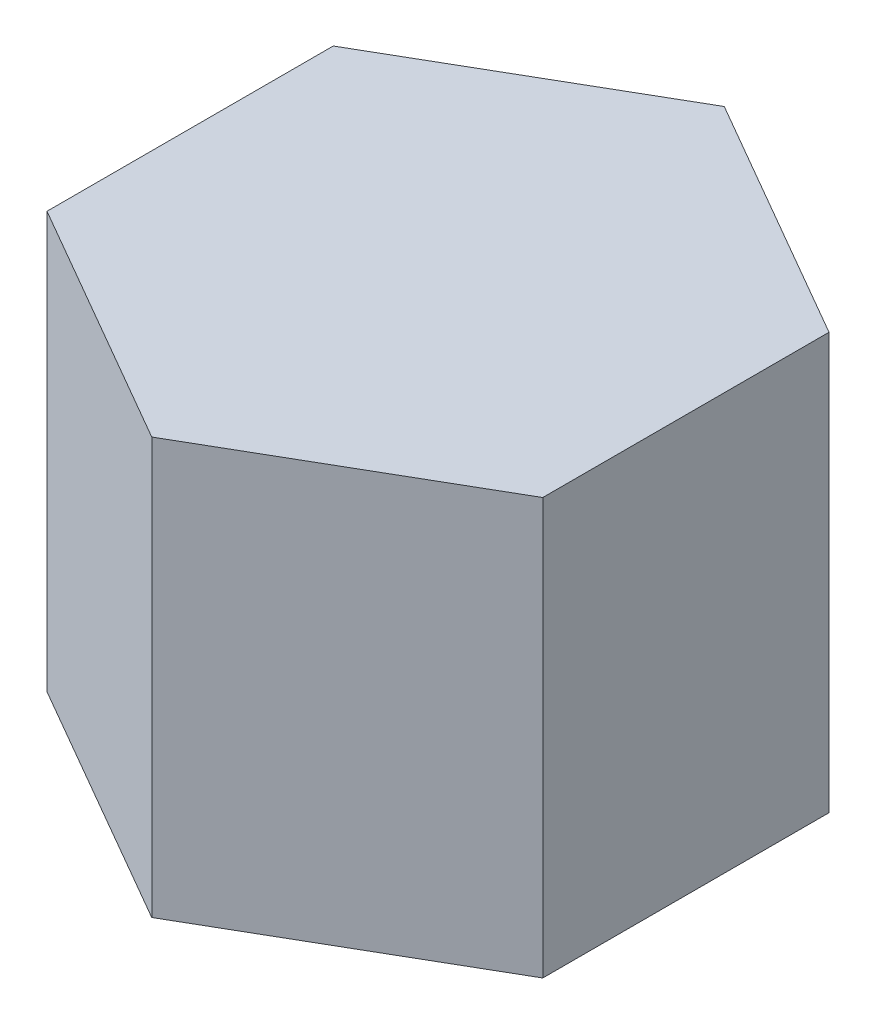
ISO-10303-21;
HEADER;
FILE_DESCRIPTION(('STEP AP214'),'2;1');
FILE_NAME('part.step','',(''),(''),'','','');
FILE_SCHEMA(('AUTOMOTIVE_DESIGN { 1 0 10303 214 1 1 1 1 }'));
ENDSEC;
DATA;
#1=APPLICATION_CONTEXT('core data for automotive mechanical design processes');
#2=APPLICATION_PROTOCOL_DEFINITION('international standard','automotive_design',2000,#1);
#3=PRODUCT_CONTEXT('',#1,'mechanical');
#4=PRODUCT('Part','Part','',(#3));
#5=PRODUCT_RELATED_PRODUCT_CATEGORY('part','',(#4));
#6=PRODUCT_DEFINITION_FORMATION('','',#4);
#7=PRODUCT_DEFINITION_CONTEXT('part definition',#1,'design');
#8=PRODUCT_DEFINITION('design','',#6,#7);
#9=PRODUCT_DEFINITION_SHAPE('','',#8);
#10=(LENGTH_UNIT() NAMED_UNIT(*) SI_UNIT(.MILLI.,.METRE.));
#11=(NAMED_UNIT(*) PLANE_ANGLE_UNIT() SI_UNIT($,.RADIAN.));
#12=(NAMED_UNIT(*) SI_UNIT($,.STERADIAN.) SOLID_ANGLE_UNIT());
#13=UNCERTAINTY_MEASURE_WITH_UNIT(LENGTH_MEASURE(1.E-05),#10,'distance_accuracy_value','');
#14=(GEOMETRIC_REPRESENTATION_CONTEXT(3) GLOBAL_UNCERTAINTY_ASSIGNED_CONTEXT((#13)) GLOBAL_UNIT_ASSIGNED_CONTEXT((#10,
#11,#12)) REPRESENTATION_CONTEXT('',''));
#15=CARTESIAN_POINT('',(0.,0.,0.));
#16=DIRECTION('',(0.,0.,1.));
#17=DIRECTION('',(1.,0.,0.));
#18=AXIS2_PLACEMENT_3D('',#15,#16,#17);
#19=CARTESIAN_POINT('',(205.339551417382,-147.556598747966,293.414022028063));
#20=DIRECTION('',(-0.500000000000096,0.,-0.866025403784383));
#21=DIRECTION('',(-0.866025403784383,0.,0.500000000000096));
#22=AXIS2_PLACEMENT_3D('',#19,#20,#21);
#23=PLANE('',#22);
#24=CARTESIAN_POINT('',(205.642660308706,-147.047793579175,293.239022028063));
#25=DIRECTION('',(-0.866025403784383,0.,0.500000000000096));
#26=VECTOR('',#25,1.);
#27=LINE('',#24,#26);
#28=CARTESIAN_POINT('',(205.642660308706,-147.047793579175,293.239022028063));
#29=VERTEX_POINT('',#28);
#30=CARTESIAN_POINT('',(205.339551417382,-147.047793579175,293.414022028063));
#31=VERTEX_POINT('',#30);
#32=EDGE_CURVE('E170',#29,#31,#27,.T.);
#33=ORIENTED_EDGE('',*,*,#32,.T.);
#34=CARTESIAN_POINT('',(205.339551417382,-147.556598747966,293.414022028063));
#35=DIRECTION('',(0.,1.,0.));
#36=VECTOR('',#35,1.);
#37=LINE('',#34,#36);
#38=CARTESIAN_POINT('',(205.339551417382,-147.556598747966,293.414022028063));
#39=VERTEX_POINT('',#38);
#40=EDGE_CURVE('E35',#39,#31,#37,.T.);
#41=ORIENTED_EDGE('',*,*,#40,.F.);
#42=CARTESIAN_POINT('',(205.642660308706,-147.556598747966,293.239022028063));
#43=DIRECTION('',(-0.866025403784383,0.,0.500000000000096));
#44=VECTOR('',#43,1.);
#45=LINE('',#42,#44);
#46=CARTESIAN_POINT('',(205.642660308706,-147.556598747966,293.239022028063));
#47=VERTEX_POINT('',#46);
#48=EDGE_CURVE('E159',#47,#39,#45,.T.);
#49=ORIENTED_EDGE('',*,*,#48,.F.);
#50=CARTESIAN_POINT('',(205.642660308706,-147.556598747966,293.239022028063));
#51=DIRECTION('',(0.,1.,0.));
#52=VECTOR('',#51,1.);
#53=LINE('',#50,#52);
#54=EDGE_CURVE('E10',#47,#29,#53,.T.);
#55=ORIENTED_EDGE('',*,*,#54,.T.);
#56=EDGE_LOOP('',(#33,#41,#49,#55));
#57=FACE_BOUND('',#56,.T.);
#58=ADVANCED_FACE('F16',(#57),#23,.F.);
#59=CARTESIAN_POINT('',(205.642660308706,-147.556598747966,291.594471220494));
#60=DIRECTION('',(-1.,0.,0.));
#61=DIRECTION('',(0.,-1.,0.));
#62=AXIS2_PLACEMENT_3D('',#59,#60,#61);
#63=PLANE('',#62);
#64=CARTESIAN_POINT('',(205.642660308706,-147.047793579175,292.889022028063));
#65=DIRECTION('',(0.,0.,1.));
#66=VECTOR('',#65,1.);
#67=LINE('',#64,#66);
#68=CARTESIAN_POINT('',(205.642660308706,-147.047793579175,292.889022028063));
#69=VERTEX_POINT('',#68);
#70=EDGE_CURVE('E167',#69,#29,#67,.T.);
#71=ORIENTED_EDGE('',*,*,#70,.T.);
#72=ORIENTED_EDGE('',*,*,#54,.F.);
#73=CARTESIAN_POINT('',(205.642660308706,-147.556598747966,292.889022028063));
#74=DIRECTION('',(0.,0.,1.));
#75=VECTOR('',#74,1.);
#76=LINE('',#73,#75);
#77=CARTESIAN_POINT('',(205.642660308706,-147.556598747966,292.889022028063));
#78=VERTEX_POINT('',#77);
#79=EDGE_CURVE('E156',#78,#47,#76,.T.);
#80=ORIENTED_EDGE('',*,*,#79,.F.);
#81=CARTESIAN_POINT('',(205.642660308706,-147.556598747966,292.889022028063));
#82=DIRECTION('',(0.,1.,0.));
#83=VECTOR('',#82,1.);
#84=LINE('',#81,#83);
#85=EDGE_CURVE('E27',#78,#69,#84,.T.);
#86=ORIENTED_EDGE('',*,*,#85,.T.);
#87=EDGE_LOOP('',(#71,#72,#80,#86));
#88=FACE_BOUND('',#87,.T.);
#89=ADVANCED_FACE('F189',(#88),#63,.F.);
#90=CARTESIAN_POINT('',(205.642660308706,-147.556598747966,292.889022028063));
#91=DIRECTION('',(-0.500000000000062,0.,0.866025403784403));
#92=DIRECTION('',(0.866025403784403,0.,0.500000000000062));
#93=AXIS2_PLACEMENT_3D('',#90,#91,#92);
#94=PLANE('',#93);
#95=CARTESIAN_POINT('',(205.339551417381,-147.047793579175,292.714022028063));
#96=DIRECTION('',(0.866025403784403,0.,0.500000000000062));
#97=VECTOR('',#96,1.);
#98=LINE('',#95,#97);
#99=CARTESIAN_POINT('',(205.339551417382,-147.047793579175,292.714022028063));
#100=VERTEX_POINT('',#99);
#101=EDGE_CURVE('E163',#100,#69,#98,.T.);
#102=ORIENTED_EDGE('',*,*,#101,.T.);
#103=ORIENTED_EDGE('',*,*,#85,.F.);
#104=CARTESIAN_POINT('',(205.339551417381,-147.556598747966,292.714022028063));
#105=DIRECTION('',(0.866025403784403,0.,0.500000000000062));
#106=VECTOR('',#105,1.);
#107=LINE('',#104,#106);
#108=CARTESIAN_POINT('',(205.339551417382,-147.556598747966,292.714022028063));
#109=VERTEX_POINT('',#108);
#110=EDGE_CURVE('E106',#109,#78,#107,.T.);
#111=ORIENTED_EDGE('',*,*,#110,.F.);
#112=CARTESIAN_POINT('',(205.339551417381,-147.556598747966,292.714022028063));
#113=DIRECTION('',(0.,1.,0.));
#114=VECTOR('',#113,1.);
#115=LINE('',#112,#114);
#116=EDGE_CURVE('E94',#109,#100,#115,.T.);
#117=ORIENTED_EDGE('',*,*,#116,.T.);
#118=EDGE_LOOP('',(#102,#103,#111,#117));
#119=FACE_BOUND('',#118,.T.);
#120=ADVANCED_FACE('F198',(#119),#94,.F.);
#121=CARTESIAN_POINT('',(205.339551417382,-147.556598747966,292.714022028063));
#122=DIRECTION('',(0.500000000000062,0.,0.866025403784403));
#123=DIRECTION('',(0.866025403784403,0.,-0.500000000000062));
#124=AXIS2_PLACEMENT_3D('',#121,#122,#123);
#125=PLANE('',#124);
#126=CARTESIAN_POINT('',(205.036442526057,-147.047793579175,292.889022028063));
#127=DIRECTION('',(0.866025403784403,0.,-0.500000000000062));
#128=VECTOR('',#127,1.);
#129=LINE('',#126,#128);
#130=CARTESIAN_POINT('',(205.036442526057,-147.047793579175,292.889022028063));
#131=VERTEX_POINT('',#130);
#132=EDGE_CURVE('E162',#131,#100,#129,.T.);
#133=ORIENTED_EDGE('',*,*,#132,.T.);
#134=ORIENTED_EDGE('',*,*,#116,.F.);
#135=CARTESIAN_POINT('',(205.036442526057,-147.556598747966,292.889022028063));
#136=DIRECTION('',(0.866025403784403,0.,-0.500000000000062));
#137=VECTOR('',#136,1.);
#138=LINE('',#135,#137);
#139=CARTESIAN_POINT('',(205.036442526057,-147.556598747966,292.889022028063));
#140=VERTEX_POINT('',#139);
#141=EDGE_CURVE('E98',#140,#109,#138,.T.);
#142=ORIENTED_EDGE('',*,*,#141,.F.);
#143=CARTESIAN_POINT('',(205.036442526057,-147.556598747966,292.889022028063));
#144=DIRECTION('',(0.,1.,0.));
#145=VECTOR('',#144,1.);
#146=LINE('',#143,#145);
#147=EDGE_CURVE('E79',#140,#131,#146,.T.);
#148=ORIENTED_EDGE('',*,*,#147,.T.);
#149=EDGE_LOOP('',(#133,#134,#142,#148));
#150=FACE_BOUND('',#149,.T.);
#151=ADVANCED_FACE('F100',(#150),#125,.F.);
#152=CARTESIAN_POINT('',(205.036442526057,-147.556598747966,291.594471220494));
#153=DIRECTION('',(1.,0.,0.));
#154=DIRECTION('',(0.,1.,0.));
#155=AXIS2_PLACEMENT_3D('',#152,#153,#154);
#156=PLANE('',#155);
#157=CARTESIAN_POINT('',(205.036442526057,-147.047793579175,293.239022028063));
#158=DIRECTION('',(0.,0.,-1.));
#159=VECTOR('',#158,1.);
#160=LINE('',#157,#159);
#161=CARTESIAN_POINT('',(205.036442526057,-147.047793579175,293.239022028063));
#162=VERTEX_POINT('',#161);
#163=EDGE_CURVE('E88',#162,#131,#160,.T.);
#164=ORIENTED_EDGE('',*,*,#163,.T.);
#165=ORIENTED_EDGE('',*,*,#147,.F.);
#166=CARTESIAN_POINT('',(205.036442526057,-147.556598747966,293.239022028063));
#167=DIRECTION('',(0.,0.,-1.));
#168=VECTOR('',#167,1.);
#169=LINE('',#166,#168);
#170=CARTESIAN_POINT('',(205.036442526057,-147.556598747966,293.239022028063));
#171=VERTEX_POINT('',#170);
#172=EDGE_CURVE('E84',#171,#140,#169,.T.);
#173=ORIENTED_EDGE('',*,*,#172,.F.);
#174=CARTESIAN_POINT('',(205.036442526057,-147.556598747966,293.239022028063));
#175=DIRECTION('',(0.,1.,0.));
#176=VECTOR('',#175,1.);
#177=LINE('',#174,#176);
#178=EDGE_CURVE('E58',#171,#162,#177,.T.);
#179=ORIENTED_EDGE('',*,*,#178,.T.);
#180=EDGE_LOOP('',(#164,#165,#173,#179));
#181=FACE_BOUND('',#180,.T.);
#182=ADVANCED_FACE('F82',(#181),#156,.F.);
#183=CARTESIAN_POINT('',(205.036442526057,-147.556598747966,293.239022028063));
#184=DIRECTION('',(0.500000000000062,0.,-0.866025403784403));
#185=DIRECTION('',(-0.866025403784403,0.,-0.500000000000062));
#186=AXIS2_PLACEMENT_3D('',#183,#184,#185);
#187=PLANE('',#186);
#188=CARTESIAN_POINT('',(205.339551417382,-147.047793579175,293.414022028063));
#189=DIRECTION('',(-0.866025403784403,0.,-0.500000000000062));
#190=VECTOR('',#189,1.);
#191=LINE('',#188,#190);
#192=EDGE_CURVE('E160',#31,#162,#191,.T.);
#193=ORIENTED_EDGE('',*,*,#192,.T.);
#194=ORIENTED_EDGE('',*,*,#178,.F.);
#195=CARTESIAN_POINT('',(205.339551417382,-147.556598747966,293.414022028063));
#196=DIRECTION('',(-0.866025403784403,0.,-0.500000000000062));
#197=VECTOR('',#196,1.);
#198=LINE('',#195,#197);
#199=EDGE_CURVE('E112',#39,#171,#198,.T.);
#200=ORIENTED_EDGE('',*,*,#199,.F.);
#201=ORIENTED_EDGE('',*,*,#40,.T.);
#202=EDGE_LOOP('',(#193,#194,#200,#201));
#203=FACE_BOUND('',#202,.T.);
#204=ADVANCED_FACE('F131',(#203),#187,.F.);
#205=CARTESIAN_POINT('',(206.491105863044,-147.556598747966,291.594471220494));
#206=DIRECTION('',(0.,1.,0.));
#207=DIRECTION('',(-1.,0.,0.));
#208=AXIS2_PLACEMENT_3D('',#205,#206,#207);
#209=PLANE('',#208);
#210=ORIENTED_EDGE('',*,*,#48,.T.);
#211=ORIENTED_EDGE('',*,*,#199,.T.);
#212=ORIENTED_EDGE('',*,*,#172,.T.);
#213=ORIENTED_EDGE('',*,*,#141,.T.);
#214=ORIENTED_EDGE('',*,*,#110,.T.);
#215=ORIENTED_EDGE('',*,*,#79,.T.);
#216=EDGE_LOOP('',(#210,#211,#212,#213,#214,#215));
#217=FACE_BOUND('',#216,.T.);
#218=ADVANCED_FACE('F111',(#217),#209,.F.);
#219=CARTESIAN_POINT('',(206.491105863044,-147.047793579175,291.594471220494));
#220=DIRECTION('',(0.,1.,0.));
#221=DIRECTION('',(-1.,0.,0.));
#222=AXIS2_PLACEMENT_3D('',#219,#220,#221);
#223=PLANE('',#222);
#224=ORIENTED_EDGE('',*,*,#32,.F.);
#225=ORIENTED_EDGE('',*,*,#70,.F.);
#226=ORIENTED_EDGE('',*,*,#101,.F.);
#227=ORIENTED_EDGE('',*,*,#132,.F.);
#228=ORIENTED_EDGE('',*,*,#163,.F.);
#229=ORIENTED_EDGE('',*,*,#192,.F.);
#230=EDGE_LOOP('',(#224,#225,#226,#227,#228,#229));
#231=FACE_BOUND('',#230,.T.);
#232=ADVANCED_FACE('F130',(#231),#223,.T.);
#233=CLOSED_SHELL('',(#58,#89,#120,#151,#182,#204,#218,#232));
#234=MANIFOLD_SOLID_BREP('B1',#233);
#235=ADVANCED_BREP_SHAPE_REPRESENTATION('',(#18,#234),#14);
#236=SHAPE_DEFINITION_REPRESENTATION(#9,#235);
ENDSEC;
END-ISO-10303-21;
